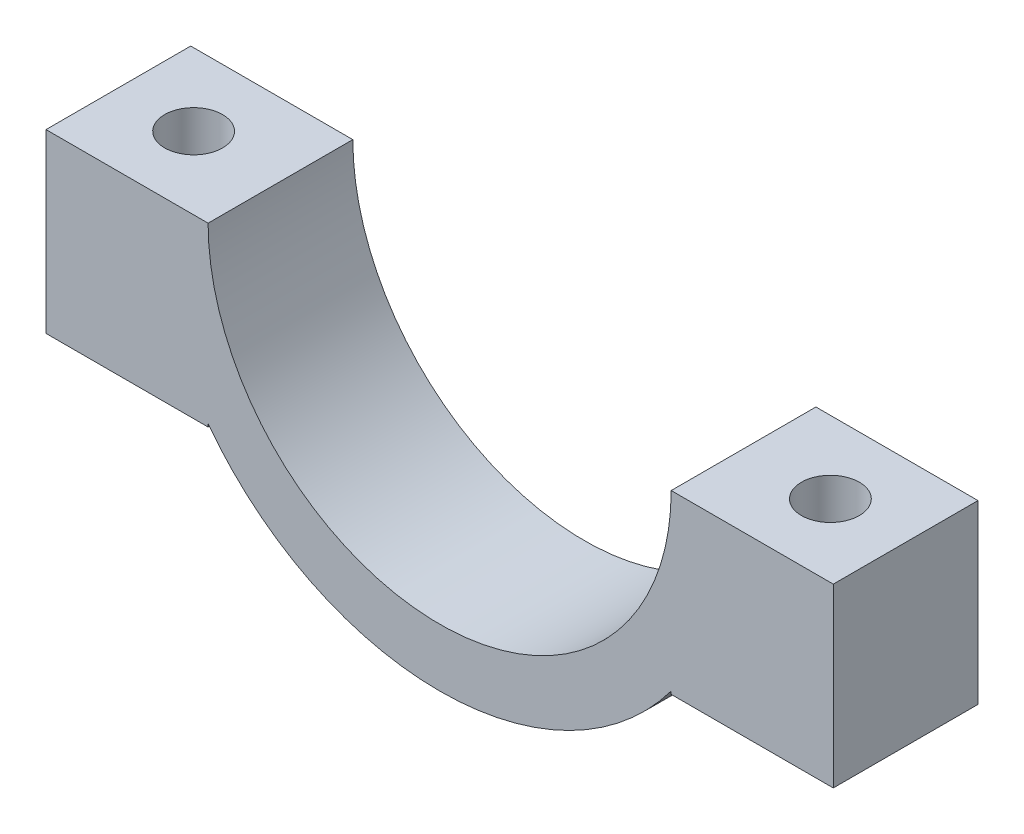
ISO-10303-21;
HEADER;
FILE_DESCRIPTION(('STEP AP214'),'2;1');
FILE_NAME('part.step','',(''),(''),'','','');
FILE_SCHEMA(('AUTOMOTIVE_DESIGN { 1 0 10303 214 1 1 1 1 }'));
ENDSEC;
DATA;
#1=APPLICATION_CONTEXT('core data for automotive mechanical design processes');
#2=APPLICATION_PROTOCOL_DEFINITION('international standard','automotive_design',2000,#1);
#3=PRODUCT_CONTEXT('',#1,'mechanical');
#4=PRODUCT('Part','Part','',(#3));
#5=PRODUCT_RELATED_PRODUCT_CATEGORY('part','',(#4));
#6=PRODUCT_DEFINITION_FORMATION('','',#4);
#7=PRODUCT_DEFINITION_CONTEXT('part definition',#1,'design');
#8=PRODUCT_DEFINITION('design','',#6,#7);
#9=PRODUCT_DEFINITION_SHAPE('','',#8);
#10=(LENGTH_UNIT() NAMED_UNIT(*) SI_UNIT(.MILLI.,.METRE.));
#11=(NAMED_UNIT(*) PLANE_ANGLE_UNIT() SI_UNIT($,.RADIAN.));
#12=(NAMED_UNIT(*) SI_UNIT($,.STERADIAN.) SOLID_ANGLE_UNIT());
#13=UNCERTAINTY_MEASURE_WITH_UNIT(LENGTH_MEASURE(1.E-05),#10,'distance_accuracy_value','');
#14=(GEOMETRIC_REPRESENTATION_CONTEXT(3) GLOBAL_UNCERTAINTY_ASSIGNED_CONTEXT((#13)) GLOBAL_UNIT_ASSIGNED_CONTEXT((#10,
#11,#12)) REPRESENTATION_CONTEXT('',''));
#15=CARTESIAN_POINT('',(0.,0.,0.));
#16=DIRECTION('',(0.,0.,1.));
#17=DIRECTION('',(1.,0.,0.));
#18=AXIS2_PLACEMENT_3D('',#15,#16,#17);
#19=CARTESIAN_POINT('',(-8.,0.,5.));
#20=DIRECTION('',(1.,0.,0.));
#21=DIRECTION('',(0.,1.,0.));
#22=AXIS2_PLACEMENT_3D('',#19,#20,#21);
#23=PLANE('',#22);
#24=DIRECTION('',(0.,-1.,0.));
#25=VECTOR('',#24,1.);
#26=CARTESIAN_POINT('',(-8.,0.,0.));
#27=LINE('',#26,#25);
#28=CARTESIAN_POINT('',(-8.,-6.00000000000001,0.));
#29=VERTEX_POINT('',#28);
#30=CARTESIAN_POINT('',(-8.,-6.1,0.));
#31=VERTEX_POINT('',#30);
#32=EDGE_CURVE('E147',#29,#31,#27,.T.);
#33=ORIENTED_EDGE('',*,*,#32,.F.);
#34=DIRECTION('',(0.,0.,-1.));
#35=VECTOR('',#34,1.);
#36=CARTESIAN_POINT('',(-8.,-6.00000000000001,5.));
#37=LINE('',#36,#35);
#38=CARTESIAN_POINT('',(-8.,-6.00000000000001,5.));
#39=VERTEX_POINT('',#38);
#40=EDGE_CURVE('E11',#39,#29,#37,.T.);
#41=ORIENTED_EDGE('',*,*,#40,.F.);
#42=DIRECTION('',(0.,-1.,0.));
#43=VECTOR('',#42,1.);
#44=CARTESIAN_POINT('',(-8.,0.,5.));
#45=LINE('',#44,#43);
#46=CARTESIAN_POINT('',(-8.,-6.1,5.));
#47=VERTEX_POINT('',#46);
#48=EDGE_CURVE('E171',#39,#47,#45,.T.);
#49=ORIENTED_EDGE('',*,*,#48,.T.);
#50=DIRECTION('',(0.,0.,-1.));
#51=VECTOR('',#50,1.);
#52=CARTESIAN_POINT('',(-8.,-6.1,5.));
#53=LINE('',#52,#51);
#54=EDGE_CURVE('E99',#47,#31,#53,.T.);
#55=ORIENTED_EDGE('',*,*,#54,.T.);
#56=EDGE_LOOP('',(#33,#41,#49,#55));
#57=FACE_BOUND('',#56,.T.);
#58=ADVANCED_FACE('F41',(#57),#23,.T.);
#59=CARTESIAN_POINT('',(0.,0.,5.));
#60=DIRECTION('',(0.,0.,-1.));
#61=DIRECTION('',(-1.,0.,0.));
#62=AXIS2_PLACEMENT_3D('',#59,#60,#61);
#63=CYLINDRICAL_SURFACE('',#62,10.);
#64=CARTESIAN_POINT('',(0.,0.,0.));
#65=DIRECTION('',(0.,0.,1.));
#66=DIRECTION('',(1.,0.,0.));
#67=AXIS2_PLACEMENT_3D('',#64,#65,#66);
#68=CIRCLE('',#67,10.);
#69=CARTESIAN_POINT('',(8.,-6.,0.));
#70=VERTEX_POINT('',#69);
#71=EDGE_CURVE('E150',#29,#70,#68,.T.);
#72=ORIENTED_EDGE('',*,*,#71,.T.);
#73=DIRECTION('',(0.,0.,-1.));
#74=VECTOR('',#73,1.);
#75=CARTESIAN_POINT('',(8.,-6.,5.));
#76=LINE('',#75,#74);
#77=CARTESIAN_POINT('',(8.,-6.,5.));
#78=VERTEX_POINT('',#77);
#79=EDGE_CURVE('E50',#78,#70,#76,.T.);
#80=ORIENTED_EDGE('',*,*,#79,.F.);
#81=CARTESIAN_POINT('',(0.,0.,5.));
#82=DIRECTION('',(0.,0.,1.));
#83=DIRECTION('',(1.,0.,0.));
#84=AXIS2_PLACEMENT_3D('',#81,#82,#83);
#85=CIRCLE('',#84,10.);
#86=EDGE_CURVE('E208',#39,#78,#85,.T.);
#87=ORIENTED_EDGE('',*,*,#86,.F.);
#88=ORIENTED_EDGE('',*,*,#40,.T.);
#89=EDGE_LOOP('',(#72,#80,#87,#88));
#90=FACE_BOUND('',#89,.T.);
#91=ADVANCED_FACE('F248',(#90),#63,.T.);
#92=CARTESIAN_POINT('',(8.,0.,5.));
#93=DIRECTION('',(1.,0.,0.));
#94=DIRECTION('',(0.,0.,-1.));
#95=AXIS2_PLACEMENT_3D('',#92,#93,#94);
#96=PLANE('',#95);
#97=DIRECTION('',(0.,-1.,0.));
#98=VECTOR('',#97,1.);
#99=CARTESIAN_POINT('',(8.,0.,0.));
#100=LINE('',#99,#98);
#101=CARTESIAN_POINT('',(8.,-6.1,0.));
#102=VERTEX_POINT('',#101);
#103=EDGE_CURVE('E152',#70,#102,#100,.T.);
#104=ORIENTED_EDGE('',*,*,#103,.T.);
#105=DIRECTION('',(0.,0.,-1.));
#106=VECTOR('',#105,1.);
#107=CARTESIAN_POINT('',(8.,-6.1,5.));
#108=LINE('',#107,#106);
#109=CARTESIAN_POINT('',(8.,-6.1,5.));
#110=VERTEX_POINT('',#109);
#111=EDGE_CURVE('E181',#110,#102,#108,.T.);
#112=ORIENTED_EDGE('',*,*,#111,.F.);
#113=DIRECTION('',(0.,-1.,0.));
#114=VECTOR('',#113,1.);
#115=CARTESIAN_POINT('',(8.,0.,5.));
#116=LINE('',#115,#114);
#117=EDGE_CURVE('E190',#78,#110,#116,.T.);
#118=ORIENTED_EDGE('',*,*,#117,.F.);
#119=ORIENTED_EDGE('',*,*,#79,.T.);
#120=EDGE_LOOP('',(#104,#112,#118,#119));
#121=FACE_BOUND('',#120,.T.);
#122=ADVANCED_FACE('F188',(#121),#96,.F.);
#123=CARTESIAN_POINT('',(0.,-6.1,5.));
#124=DIRECTION('',(0.,-1.,0.));
#125=DIRECTION('',(1.,0.,0.));
#126=AXIS2_PLACEMENT_3D('',#123,#124,#125);
#127=PLANE('',#126);
#128=CARTESIAN_POINT('',(11.,-6.1,2.49999999999884));
#129=DIRECTION('',(0.,-1.,0.));
#130=DIRECTION('',(1.,0.,0.));
#131=AXIS2_PLACEMENT_3D('',#128,#129,#130);
#132=CIRCLE('',#131,1.);
#133=CARTESIAN_POINT('',(12.,-6.1,2.49999999999884));
#134=VERTEX_POINT('',#133);
#135=EDGE_CURVE('E225',#134,#134,#132,.T.);
#136=ORIENTED_EDGE('',*,*,#135,.F.);
#137=EDGE_LOOP('',(#136));
#138=FACE_BOUND('',#137,.T.);
#139=DIRECTION('',(-1.,0.,0.));
#140=VECTOR('',#139,1.);
#141=CARTESIAN_POINT('',(0.,-6.1,0.));
#142=LINE('',#141,#140);
#143=CARTESIAN_POINT('',(13.6,-6.1,0.));
#144=VERTEX_POINT('',#143);
#145=EDGE_CURVE('E155',#144,#102,#142,.T.);
#146=ORIENTED_EDGE('',*,*,#145,.F.);
#147=DIRECTION('',(0.,0.,-1.));
#148=VECTOR('',#147,1.);
#149=CARTESIAN_POINT('',(13.6,-6.1,5.));
#150=LINE('',#149,#148);
#151=CARTESIAN_POINT('',(13.6,-6.1,5.));
#152=VERTEX_POINT('',#151);
#153=EDGE_CURVE('E179',#152,#144,#150,.T.);
#154=ORIENTED_EDGE('',*,*,#153,.F.);
#155=DIRECTION('',(-1.,0.,0.));
#156=VECTOR('',#155,1.);
#157=CARTESIAN_POINT('',(0.,-6.1,5.));
#158=LINE('',#157,#156);
#159=EDGE_CURVE('E201',#152,#110,#158,.T.);
#160=ORIENTED_EDGE('',*,*,#159,.T.);
#161=ORIENTED_EDGE('',*,*,#111,.T.);
#162=EDGE_LOOP('',(#146,#154,#160,#161));
#163=FACE_BOUND('',#162,.T.);
#164=ADVANCED_FACE('F198',(#138,#163),#127,.T.);
#165=CARTESIAN_POINT('',(13.6,0.,5.));
#166=DIRECTION('',(1.,0.,0.));
#167=DIRECTION('',(0.,0.,-1.));
#168=AXIS2_PLACEMENT_3D('',#165,#166,#167);
#169=PLANE('',#168);
#170=DIRECTION('',(0.,-1.,0.));
#171=VECTOR('',#170,1.);
#172=CARTESIAN_POINT('',(13.6,0.,0.));
#173=LINE('',#172,#171);
#174=CARTESIAN_POINT('',(13.6,0.,0.));
#175=VERTEX_POINT('',#174);
#176=EDGE_CURVE('E158',#175,#144,#173,.T.);
#177=ORIENTED_EDGE('',*,*,#176,.F.);
#178=DIRECTION('',(0.,0.,-1.));
#179=VECTOR('',#178,1.);
#180=CARTESIAN_POINT('',(13.6,0.,5.));
#181=LINE('',#180,#179);
#182=CARTESIAN_POINT('',(13.6,0.,5.));
#183=VERTEX_POINT('',#182);
#184=EDGE_CURVE('E177',#183,#175,#181,.T.);
#185=ORIENTED_EDGE('',*,*,#184,.F.);
#186=DIRECTION('',(0.,-1.,0.));
#187=VECTOR('',#186,1.);
#188=CARTESIAN_POINT('',(13.6,0.,5.));
#189=LINE('',#188,#187);
#190=EDGE_CURVE('E204',#183,#152,#189,.T.);
#191=ORIENTED_EDGE('',*,*,#190,.T.);
#192=ORIENTED_EDGE('',*,*,#153,.T.);
#193=EDGE_LOOP('',(#177,#185,#191,#192));
#194=FACE_BOUND('',#193,.T.);
#195=ADVANCED_FACE('F237',(#194),#169,.T.);
#196=CARTESIAN_POINT('',(0.,0.,5.));
#197=DIRECTION('',(0.,1.,0.));
#198=DIRECTION('',(0.,0.,1.));
#199=AXIS2_PLACEMENT_3D('',#196,#197,#198);
#200=PLANE('',#199);
#201=CARTESIAN_POINT('',(11.,0.,2.49999999999884));
#202=DIRECTION('',(0.,1.,0.));
#203=DIRECTION('',(-1.,0.,0.));
#204=AXIS2_PLACEMENT_3D('',#201,#202,#203);
#205=CIRCLE('',#204,1.);
#206=CARTESIAN_POINT('',(10.,0.,2.49999999999884));
#207=VERTEX_POINT('',#206);
#208=EDGE_CURVE('E228',#207,#207,#205,.T.);
#209=ORIENTED_EDGE('',*,*,#208,.F.);
#210=EDGE_LOOP('',(#209));
#211=FACE_BOUND('',#210,.T.);
#212=DIRECTION('',(1.,0.,0.));
#213=VECTOR('',#212,1.);
#214=CARTESIAN_POINT('',(0.,0.,0.));
#215=LINE('',#214,#213);
#216=CARTESIAN_POINT('',(8.,0.,0.));
#217=VERTEX_POINT('',#216);
#218=EDGE_CURVE('E161',#217,#175,#215,.T.);
#219=ORIENTED_EDGE('',*,*,#218,.F.);
#220=DIRECTION('',(0.,0.,-1.));
#221=VECTOR('',#220,1.);
#222=CARTESIAN_POINT('',(8.,0.,5.));
#223=LINE('',#222,#221);
#224=CARTESIAN_POINT('',(8.,0.,5.));
#225=VERTEX_POINT('',#224);
#226=EDGE_CURVE('E175',#225,#217,#223,.T.);
#227=ORIENTED_EDGE('',*,*,#226,.F.);
#228=DIRECTION('',(1.,0.,0.));
#229=VECTOR('',#228,1.);
#230=CARTESIAN_POINT('',(0.,0.,5.));
#231=LINE('',#230,#229);
#232=EDGE_CURVE('E206',#225,#183,#231,.T.);
#233=ORIENTED_EDGE('',*,*,#232,.T.);
#234=ORIENTED_EDGE('',*,*,#184,.T.);
#235=EDGE_LOOP('',(#219,#227,#233,#234));
#236=FACE_BOUND('',#235,.T.);
#237=ADVANCED_FACE('F234',(#211,#236),#200,.T.);
#238=CARTESIAN_POINT('',(0.,0.,5.));
#239=DIRECTION('',(0.,0.,-1.));
#240=DIRECTION('',(-1.,0.,0.));
#241=AXIS2_PLACEMENT_3D('',#238,#239,#240);
#242=CYLINDRICAL_SURFACE('',#241,8.);
#243=CARTESIAN_POINT('',(0.,0.,0.));
#244=DIRECTION('',(0.,0.,1.));
#245=DIRECTION('',(1.,0.,0.));
#246=AXIS2_PLACEMENT_3D('',#243,#244,#245);
#247=CIRCLE('',#246,8.);
#248=CARTESIAN_POINT('',(-8.,0.,0.));
#249=VERTEX_POINT('',#248);
#250=EDGE_CURVE('E164',#249,#217,#247,.T.);
#251=ORIENTED_EDGE('',*,*,#250,.F.);
#252=DIRECTION('',(0.,0.,-1.));
#253=VECTOR('',#252,1.);
#254=CARTESIAN_POINT('',(-8.,0.,5.));
#255=LINE('',#254,#253);
#256=CARTESIAN_POINT('',(-8.,0.,5.));
#257=VERTEX_POINT('',#256);
#258=EDGE_CURVE('E139',#257,#249,#255,.T.);
#259=ORIENTED_EDGE('',*,*,#258,.F.);
#260=CARTESIAN_POINT('',(0.,0.,5.));
#261=DIRECTION('',(0.,0.,1.));
#262=DIRECTION('',(1.,0.,0.));
#263=AXIS2_PLACEMENT_3D('',#260,#261,#262);
#264=CIRCLE('',#263,8.);
#265=EDGE_CURVE('E132',#257,#225,#264,.T.);
#266=ORIENTED_EDGE('',*,*,#265,.T.);
#267=ORIENTED_EDGE('',*,*,#226,.T.);
#268=EDGE_LOOP('',(#251,#259,#266,#267));
#269=FACE_BOUND('',#268,.T.);
#270=ADVANCED_FACE('F215',(#269),#242,.F.);
#271=CARTESIAN_POINT('',(0.,0.,5.));
#272=DIRECTION('',(0.,-1.,0.));
#273=DIRECTION('',(1.,0.,0.));
#274=AXIS2_PLACEMENT_3D('',#271,#272,#273);
#275=PLANE('',#274);
#276=CARTESIAN_POINT('',(-11.,0.,2.49999999999886));
#277=DIRECTION('',(0.,1.,0.));
#278=DIRECTION('',(-1.,0.,0.));
#279=AXIS2_PLACEMENT_3D('',#276,#277,#278);
#280=CIRCLE('',#279,1.);
#281=CARTESIAN_POINT('',(-12.,0.,2.49999999999886));
#282=VERTEX_POINT('',#281);
#283=EDGE_CURVE('E222',#282,#282,#280,.T.);
#284=ORIENTED_EDGE('',*,*,#283,.F.);
#285=EDGE_LOOP('',(#284));
#286=FACE_BOUND('',#285,.T.);
#287=DIRECTION('',(-1.,0.,0.));
#288=VECTOR('',#287,1.);
#289=CARTESIAN_POINT('',(0.,0.,0.));
#290=LINE('',#289,#288);
#291=CARTESIAN_POINT('',(-13.6,0.,0.));
#292=VERTEX_POINT('',#291);
#293=EDGE_CURVE('E138',#249,#292,#290,.T.);
#294=ORIENTED_EDGE('',*,*,#293,.T.);
#295=DIRECTION('',(0.,0.,-1.));
#296=VECTOR('',#295,1.);
#297=CARTESIAN_POINT('',(-13.6,0.,5.));
#298=LINE('',#297,#296);
#299=CARTESIAN_POINT('',(-13.6,0.,5.));
#300=VERTEX_POINT('',#299);
#301=EDGE_CURVE('E135',#300,#292,#298,.T.);
#302=ORIENTED_EDGE('',*,*,#301,.F.);
#303=DIRECTION('',(-1.,0.,0.));
#304=VECTOR('',#303,1.);
#305=CARTESIAN_POINT('',(0.,0.,5.));
#306=LINE('',#305,#304);
#307=EDGE_CURVE('E125',#257,#300,#306,.T.);
#308=ORIENTED_EDGE('',*,*,#307,.F.);
#309=ORIENTED_EDGE('',*,*,#258,.T.);
#310=EDGE_LOOP('',(#294,#302,#308,#309));
#311=FACE_BOUND('',#310,.T.);
#312=ADVANCED_FACE('F136',(#286,#311),#275,.F.);
#313=CARTESIAN_POINT('',(-13.6,0.,5.));
#314=DIRECTION('',(1.,0.,0.));
#315=DIRECTION('',(0.,0.,-1.));
#316=AXIS2_PLACEMENT_3D('',#313,#314,#315);
#317=PLANE('',#316);
#318=DIRECTION('',(0.,-1.,0.));
#319=VECTOR('',#318,1.);
#320=CARTESIAN_POINT('',(-13.6,0.,0.));
#321=LINE('',#320,#319);
#322=CARTESIAN_POINT('',(-13.6,-6.1,0.));
#323=VERTEX_POINT('',#322);
#324=EDGE_CURVE('E92',#292,#323,#321,.T.);
#325=ORIENTED_EDGE('',*,*,#324,.T.);
#326=DIRECTION('',(0.,0.,-1.));
#327=VECTOR('',#326,1.);
#328=CARTESIAN_POINT('',(-13.6,-6.1,5.));
#329=LINE('',#328,#327);
#330=CARTESIAN_POINT('',(-13.6,-6.1,5.));
#331=VERTEX_POINT('',#330);
#332=EDGE_CURVE('E140',#331,#323,#329,.T.);
#333=ORIENTED_EDGE('',*,*,#332,.F.);
#334=DIRECTION('',(0.,-1.,0.));
#335=VECTOR('',#334,1.);
#336=CARTESIAN_POINT('',(-13.6,0.,5.));
#337=LINE('',#336,#335);
#338=EDGE_CURVE('E129',#300,#331,#337,.T.);
#339=ORIENTED_EDGE('',*,*,#338,.F.);
#340=ORIENTED_EDGE('',*,*,#301,.T.);
#341=EDGE_LOOP('',(#325,#333,#339,#340));
#342=FACE_BOUND('',#341,.T.);
#343=ADVANCED_FACE('F142',(#342),#317,.F.);
#344=CARTESIAN_POINT('',(0.,-6.1,5.));
#345=DIRECTION('',(0.,1.,0.));
#346=DIRECTION('',(0.,0.,1.));
#347=AXIS2_PLACEMENT_3D('',#344,#345,#346);
#348=PLANE('',#347);
#349=CARTESIAN_POINT('',(-11.,-6.1,2.49999999999886));
#350=DIRECTION('',(0.,1.,0.));
#351=DIRECTION('',(0.,0.,1.));
#352=AXIS2_PLACEMENT_3D('',#349,#350,#351);
#353=CIRCLE('',#352,1.);
#354=CARTESIAN_POINT('',(-11.,-6.1,3.49999999999886));
#355=VERTEX_POINT('',#354);
#356=EDGE_CURVE('E44',#355,#355,#353,.T.);
#357=ORIENTED_EDGE('',*,*,#356,.T.);
#358=EDGE_LOOP('',(#357));
#359=FACE_BOUND('',#358,.T.);
#360=DIRECTION('',(1.,0.,0.));
#361=VECTOR('',#360,1.);
#362=CARTESIAN_POINT('',(0.,-6.1,0.));
#363=LINE('',#362,#361);
#364=EDGE_CURVE('E169',#323,#31,#363,.T.);
#365=ORIENTED_EDGE('',*,*,#364,.T.);
#366=ORIENTED_EDGE('',*,*,#54,.F.);
#367=DIRECTION('',(1.,0.,0.));
#368=VECTOR('',#367,1.);
#369=CARTESIAN_POINT('',(0.,-6.1,5.));
#370=LINE('',#369,#368);
#371=EDGE_CURVE('E58',#331,#47,#370,.T.);
#372=ORIENTED_EDGE('',*,*,#371,.F.);
#373=ORIENTED_EDGE('',*,*,#332,.T.);
#374=EDGE_LOOP('',(#365,#366,#372,#373));
#375=FACE_BOUND('',#374,.T.);
#376=ADVANCED_FACE('F219',(#359,#375),#348,.F.);
#377=CARTESIAN_POINT('',(0.,0.,5.));
#378=DIRECTION('',(0.,0.,1.));
#379=DIRECTION('',(1.,0.,0.));
#380=AXIS2_PLACEMENT_3D('',#377,#378,#379);
#381=PLANE('',#380);
#382=ORIENTED_EDGE('',*,*,#48,.F.);
#383=ORIENTED_EDGE('',*,*,#86,.T.);
#384=ORIENTED_EDGE('',*,*,#117,.T.);
#385=ORIENTED_EDGE('',*,*,#159,.F.);
#386=ORIENTED_EDGE('',*,*,#190,.F.);
#387=ORIENTED_EDGE('',*,*,#232,.F.);
#388=ORIENTED_EDGE('',*,*,#265,.F.);
#389=ORIENTED_EDGE('',*,*,#307,.T.);
#390=ORIENTED_EDGE('',*,*,#338,.T.);
#391=ORIENTED_EDGE('',*,*,#371,.T.);
#392=EDGE_LOOP('',(#382,#383,#384,#385,#386,#387,#388,#389,#390,#391));
#393=FACE_BOUND('',#392,.T.);
#394=ADVANCED_FACE('F127',(#393),#381,.T.);
#395=CARTESIAN_POINT('',(0.,0.,0.));
#396=DIRECTION('',(0.,0.,1.));
#397=DIRECTION('',(1.,0.,0.));
#398=AXIS2_PLACEMENT_3D('',#395,#396,#397);
#399=PLANE('',#398);
#400=ORIENTED_EDGE('',*,*,#32,.T.);
#401=ORIENTED_EDGE('',*,*,#364,.F.);
#402=ORIENTED_EDGE('',*,*,#324,.F.);
#403=ORIENTED_EDGE('',*,*,#293,.F.);
#404=ORIENTED_EDGE('',*,*,#250,.T.);
#405=ORIENTED_EDGE('',*,*,#218,.T.);
#406=ORIENTED_EDGE('',*,*,#176,.T.);
#407=ORIENTED_EDGE('',*,*,#145,.T.);
#408=ORIENTED_EDGE('',*,*,#103,.F.);
#409=ORIENTED_EDGE('',*,*,#71,.F.);
#410=EDGE_LOOP('',(#400,#401,#402,#403,#404,#405,#406,#407,#408,#409));
#411=FACE_BOUND('',#410,.T.);
#412=ADVANCED_FACE('F194',(#411),#399,.F.);
#413=CARTESIAN_POINT('',(-11.,-10.,2.49999999999886));
#414=DIRECTION('',(0.,1.,0.));
#415=DIRECTION('',(-1.,0.,0.));
#416=AXIS2_PLACEMENT_3D('',#413,#414,#415);
#417=CYLINDRICAL_SURFACE('',#416,1.);
#418=ORIENTED_EDGE('',*,*,#283,.T.);
#419=EDGE_LOOP('',(#418));
#420=FACE_BOUND('',#419,.T.);
#421=ORIENTED_EDGE('',*,*,#356,.F.);
#422=EDGE_LOOP('',(#421));
#423=FACE_BOUND('',#422,.T.);
#424=ADVANCED_FACE('F279',(#420,#423),#417,.F.);
#425=CARTESIAN_POINT('',(11.,-10.,2.49999999999884));
#426=DIRECTION('',(0.,1.,0.));
#427=DIRECTION('',(-1.,0.,0.));
#428=AXIS2_PLACEMENT_3D('',#425,#426,#427);
#429=CYLINDRICAL_SURFACE('',#428,1.);
#430=ORIENTED_EDGE('',*,*,#135,.T.);
#431=EDGE_LOOP('',(#430));
#432=FACE_BOUND('',#431,.T.);
#433=ORIENTED_EDGE('',*,*,#208,.T.);
#434=EDGE_LOOP('',(#433));
#435=FACE_BOUND('',#434,.T.);
#436=ADVANCED_FACE('F232',(#432,#435),#429,.F.);
#437=CLOSED_SHELL('',(#58,#91,#122,#164,#195,#237,#270,#312,#343,#376,#394,#412,#424,#436));
#438=MANIFOLD_SOLID_BREP('B2',#437);
#439=ADVANCED_BREP_SHAPE_REPRESENTATION('',(#18,#438),#14);
#440=SHAPE_DEFINITION_REPRESENTATION(#9,#439);
ENDSEC;
END-ISO-10303-21;
